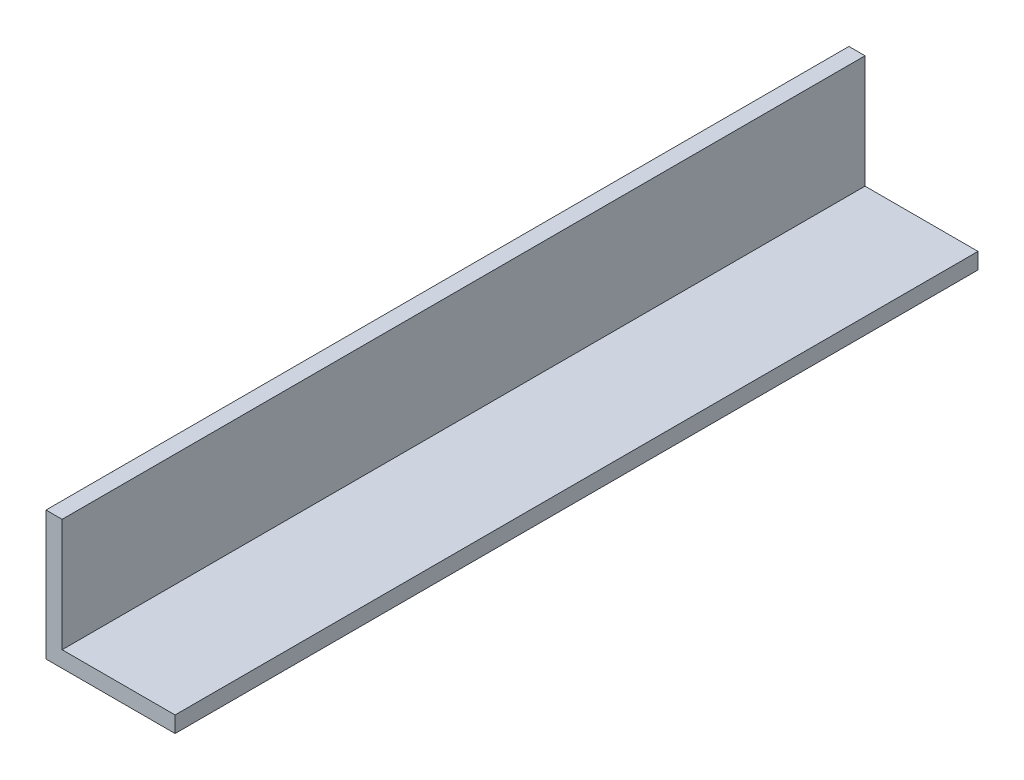
ISO-10303-21;
HEADER;
FILE_DESCRIPTION(('STEP AP214'),'2;1');
FILE_NAME('part.step','',(''),(''),'','','');
FILE_SCHEMA(('AUTOMOTIVE_DESIGN { 1 0 10303 214 1 1 1 1 }'));
ENDSEC;
DATA;
#1=APPLICATION_CONTEXT('core data for automotive mechanical design processes');
#2=APPLICATION_PROTOCOL_DEFINITION('international standard','automotive_design',2000,#1);
#3=PRODUCT_CONTEXT('',#1,'mechanical');
#4=PRODUCT('Part','Part','',(#3));
#5=PRODUCT_RELATED_PRODUCT_CATEGORY('part','',(#4));
#6=PRODUCT_DEFINITION_FORMATION('','',#4);
#7=PRODUCT_DEFINITION_CONTEXT('part definition',#1,'design');
#8=PRODUCT_DEFINITION('design','',#6,#7);
#9=PRODUCT_DEFINITION_SHAPE('','',#8);
#10=(LENGTH_UNIT() NAMED_UNIT(*) SI_UNIT(.MILLI.,.METRE.));
#11=(NAMED_UNIT(*) PLANE_ANGLE_UNIT() SI_UNIT($,.RADIAN.));
#12=(NAMED_UNIT(*) SI_UNIT($,.STERADIAN.) SOLID_ANGLE_UNIT());
#13=UNCERTAINTY_MEASURE_WITH_UNIT(LENGTH_MEASURE(1.E-05),#10,'distance_accuracy_value','');
#14=(GEOMETRIC_REPRESENTATION_CONTEXT(3) GLOBAL_UNCERTAINTY_ASSIGNED_CONTEXT((#13)) GLOBAL_UNIT_ASSIGNED_CONTEXT((#10,
#11,#12)) REPRESENTATION_CONTEXT('',''));
#15=CARTESIAN_POINT('',(0.,0.,0.));
#16=DIRECTION('',(0.,0.,1.));
#17=DIRECTION('',(1.,0.,0.));
#18=AXIS2_PLACEMENT_3D('',#15,#16,#17);
#19=CARTESIAN_POINT('',(0.,0.,158.));
#20=DIRECTION('',(1.,0.,0.));
#21=DIRECTION('',(0.,0.,-1.));
#22=AXIS2_PLACEMENT_3D('',#19,#20,#21);
#23=PLANE('',#22);
#24=DIRECTION('',(0.,-1.,0.));
#25=VECTOR('',#24,1.);
#26=CARTESIAN_POINT('',(0.,0.,0.));
#27=LINE('',#26,#25);
#28=CARTESIAN_POINT('',(0.,25.4,0.));
#29=VERTEX_POINT('',#28);
#30=CARTESIAN_POINT('',(0.,0.,0.));
#31=VERTEX_POINT('',#30);
#32=EDGE_CURVE('E117',#29,#31,#27,.T.);
#33=ORIENTED_EDGE('',*,*,#32,.T.);
#34=DIRECTION('',(0.,0.,-1.));
#35=VECTOR('',#34,1.);
#36=CARTESIAN_POINT('',(0.,0.,158.));
#37=LINE('',#36,#35);
#38=CARTESIAN_POINT('',(0.,0.,158.));
#39=VERTEX_POINT('',#38);
#40=EDGE_CURVE('E11',#39,#31,#37,.T.);
#41=ORIENTED_EDGE('',*,*,#40,.F.);
#42=DIRECTION('',(0.,-1.,0.));
#43=VECTOR('',#42,1.);
#44=CARTESIAN_POINT('',(0.,0.,158.));
#45=LINE('',#44,#43);
#46=CARTESIAN_POINT('',(0.,25.4,158.));
#47=VERTEX_POINT('',#46);
#48=EDGE_CURVE('E127',#47,#39,#45,.T.);
#49=ORIENTED_EDGE('',*,*,#48,.F.);
#50=DIRECTION('',(0.,0.,-1.));
#51=VECTOR('',#50,1.);
#52=CARTESIAN_POINT('',(0.,25.4,158.));
#53=LINE('',#52,#51);
#54=EDGE_CURVE('E113',#47,#29,#53,.T.);
#55=ORIENTED_EDGE('',*,*,#54,.T.);
#56=EDGE_LOOP('',(#33,#41,#49,#55));
#57=FACE_BOUND('',#56,.T.);
#58=ADVANCED_FACE('F33',(#57),#23,.F.);
#59=CARTESIAN_POINT('',(0.,0.,158.));
#60=DIRECTION('',(0.,1.,0.));
#61=DIRECTION('',(0.,0.,1.));
#62=AXIS2_PLACEMENT_3D('',#59,#60,#61);
#63=PLANE('',#62);
#64=DIRECTION('',(1.,0.,0.));
#65=VECTOR('',#64,1.);
#66=CARTESIAN_POINT('',(0.,0.,0.));
#67=LINE('',#66,#65);
#68=CARTESIAN_POINT('',(25.4,0.,0.));
#69=VERTEX_POINT('',#68);
#70=EDGE_CURVE('E120',#31,#69,#67,.T.);
#71=ORIENTED_EDGE('',*,*,#70,.T.);
#72=DIRECTION('',(0.,0.,-1.));
#73=VECTOR('',#72,1.);
#74=CARTESIAN_POINT('',(25.4,0.,158.));
#75=LINE('',#74,#73);
#76=CARTESIAN_POINT('',(25.4,0.,158.));
#77=VERTEX_POINT('',#76);
#78=EDGE_CURVE('E41',#77,#69,#75,.T.);
#79=ORIENTED_EDGE('',*,*,#78,.F.);
#80=DIRECTION('',(1.,0.,0.));
#81=VECTOR('',#80,1.);
#82=CARTESIAN_POINT('',(0.,0.,158.));
#83=LINE('',#82,#81);
#84=EDGE_CURVE('E86',#39,#77,#83,.T.);
#85=ORIENTED_EDGE('',*,*,#84,.F.);
#86=ORIENTED_EDGE('',*,*,#40,.T.);
#87=EDGE_LOOP('',(#71,#79,#85,#86));
#88=FACE_BOUND('',#87,.T.);
#89=ADVANCED_FACE('F151',(#88),#63,.F.);
#90=CARTESIAN_POINT('',(25.4,0.,158.));
#91=DIRECTION('',(-1.,0.,0.));
#92=DIRECTION('',(0.,0.,1.));
#93=AXIS2_PLACEMENT_3D('',#90,#91,#92);
#94=PLANE('',#93);
#95=DIRECTION('',(0.,1.,0.));
#96=VECTOR('',#95,1.);
#97=CARTESIAN_POINT('',(25.4,0.,0.));
#98=LINE('',#97,#96);
#99=CARTESIAN_POINT('',(25.4,3.175,0.));
#100=VERTEX_POINT('',#99);
#101=EDGE_CURVE('E122',#69,#100,#98,.T.);
#102=ORIENTED_EDGE('',*,*,#101,.T.);
#103=DIRECTION('',(0.,0.,-1.));
#104=VECTOR('',#103,1.);
#105=CARTESIAN_POINT('',(25.4,3.175,158.));
#106=LINE('',#105,#104);
#107=CARTESIAN_POINT('',(25.4,3.175,158.));
#108=VERTEX_POINT('',#107);
#109=EDGE_CURVE('E108',#108,#100,#106,.T.);
#110=ORIENTED_EDGE('',*,*,#109,.F.);
#111=DIRECTION('',(0.,1.,0.));
#112=VECTOR('',#111,1.);
#113=CARTESIAN_POINT('',(25.4,0.,158.));
#114=LINE('',#113,#112);
#115=EDGE_CURVE('E99',#77,#108,#114,.T.);
#116=ORIENTED_EDGE('',*,*,#115,.F.);
#117=ORIENTED_EDGE('',*,*,#78,.T.);
#118=EDGE_LOOP('',(#102,#110,#116,#117));
#119=FACE_BOUND('',#118,.T.);
#120=ADVANCED_FACE('F133',(#119),#94,.F.);
#121=CARTESIAN_POINT('',(25.4,3.175,158.));
#122=DIRECTION('',(0.,-1.,0.));
#123=DIRECTION('',(1.,0.,0.));
#124=AXIS2_PLACEMENT_3D('',#121,#122,#123);
#125=PLANE('',#124);
#126=DIRECTION('',(-1.,0.,0.));
#127=VECTOR('',#126,1.);
#128=CARTESIAN_POINT('',(25.4,3.175,0.));
#129=LINE('',#128,#127);
#130=CARTESIAN_POINT('',(3.175,3.175,0.));
#131=VERTEX_POINT('',#130);
#132=EDGE_CURVE('E107',#100,#131,#129,.T.);
#133=ORIENTED_EDGE('',*,*,#132,.T.);
#134=DIRECTION('',(0.,0.,-1.));
#135=VECTOR('',#134,1.);
#136=CARTESIAN_POINT('',(3.175,3.175,158.));
#137=LINE('',#136,#135);
#138=CARTESIAN_POINT('',(3.175,3.175,158.));
#139=VERTEX_POINT('',#138);
#140=EDGE_CURVE('E104',#139,#131,#137,.T.);
#141=ORIENTED_EDGE('',*,*,#140,.F.);
#142=DIRECTION('',(-1.,0.,0.));
#143=VECTOR('',#142,1.);
#144=CARTESIAN_POINT('',(25.4,3.175,158.));
#145=LINE('',#144,#143);
#146=EDGE_CURVE('E93',#108,#139,#145,.T.);
#147=ORIENTED_EDGE('',*,*,#146,.F.);
#148=ORIENTED_EDGE('',*,*,#109,.T.);
#149=EDGE_LOOP('',(#133,#141,#147,#148));
#150=FACE_BOUND('',#149,.T.);
#151=ADVANCED_FACE('F105',(#150),#125,.F.);
#152=CARTESIAN_POINT('',(3.175,25.4,158.));
#153=DIRECTION('',(-1.,0.,0.));
#154=DIRECTION('',(0.,-1.,0.));
#155=AXIS2_PLACEMENT_3D('',#152,#153,#154);
#156=PLANE('',#155);
#157=DIRECTION('',(0.,1.,0.));
#158=VECTOR('',#157,1.);
#159=CARTESIAN_POINT('',(3.175,25.4,0.));
#160=LINE('',#159,#158);
#161=CARTESIAN_POINT('',(3.175,25.4,0.));
#162=VERTEX_POINT('',#161);
#163=EDGE_CURVE('E72',#131,#162,#160,.T.);
#164=ORIENTED_EDGE('',*,*,#163,.T.);
#165=DIRECTION('',(0.,0.,-1.));
#166=VECTOR('',#165,1.);
#167=CARTESIAN_POINT('',(3.175,25.4,158.));
#168=LINE('',#167,#166);
#169=CARTESIAN_POINT('',(3.175,25.4,158.));
#170=VERTEX_POINT('',#169);
#171=EDGE_CURVE('E109',#170,#162,#168,.T.);
#172=ORIENTED_EDGE('',*,*,#171,.F.);
#173=DIRECTION('',(0.,1.,0.));
#174=VECTOR('',#173,1.);
#175=CARTESIAN_POINT('',(3.175,25.4,158.));
#176=LINE('',#175,#174);
#177=EDGE_CURVE('E97',#139,#170,#176,.T.);
#178=ORIENTED_EDGE('',*,*,#177,.F.);
#179=ORIENTED_EDGE('',*,*,#140,.T.);
#180=EDGE_LOOP('',(#164,#172,#178,#179));
#181=FACE_BOUND('',#180,.T.);
#182=ADVANCED_FACE('F111',(#181),#156,.F.);
#183=CARTESIAN_POINT('',(0.,25.4,158.));
#184=DIRECTION('',(0.,-1.,0.));
#185=DIRECTION('',(0.,0.,-1.));
#186=AXIS2_PLACEMENT_3D('',#183,#184,#185);
#187=PLANE('',#186);
#188=DIRECTION('',(-1.,0.,0.));
#189=VECTOR('',#188,1.);
#190=CARTESIAN_POINT('',(0.,25.4,0.));
#191=LINE('',#190,#189);
#192=EDGE_CURVE('E78',#162,#29,#191,.T.);
#193=ORIENTED_EDGE('',*,*,#192,.T.);
#194=ORIENTED_EDGE('',*,*,#54,.F.);
#195=DIRECTION('',(-1.,0.,0.));
#196=VECTOR('',#195,1.);
#197=CARTESIAN_POINT('',(0.,25.4,158.));
#198=LINE('',#197,#196);
#199=EDGE_CURVE('E49',#170,#47,#198,.T.);
#200=ORIENTED_EDGE('',*,*,#199,.F.);
#201=ORIENTED_EDGE('',*,*,#171,.T.);
#202=EDGE_LOOP('',(#193,#194,#200,#201));
#203=FACE_BOUND('',#202,.T.);
#204=ADVANCED_FACE('F140',(#203),#187,.F.);
#205=CARTESIAN_POINT('',(0.,0.,158.));
#206=DIRECTION('',(0.,0.,-1.));
#207=DIRECTION('',(-1.,0.,0.));
#208=AXIS2_PLACEMENT_3D('',#205,#206,#207);
#209=PLANE('',#208);
#210=ORIENTED_EDGE('',*,*,#48,.T.);
#211=ORIENTED_EDGE('',*,*,#84,.T.);
#212=ORIENTED_EDGE('',*,*,#115,.T.);
#213=ORIENTED_EDGE('',*,*,#146,.T.);
#214=ORIENTED_EDGE('',*,*,#177,.T.);
#215=ORIENTED_EDGE('',*,*,#199,.T.);
#216=EDGE_LOOP('',(#210,#211,#212,#213,#214,#215));
#217=FACE_BOUND('',#216,.T.);
#218=ADVANCED_FACE('F95',(#217),#209,.F.);
#219=CARTESIAN_POINT('',(0.,0.,0.));
#220=DIRECTION('',(0.,0.,-1.));
#221=DIRECTION('',(-1.,0.,0.));
#222=AXIS2_PLACEMENT_3D('',#219,#220,#221);
#223=PLANE('',#222);
#224=ORIENTED_EDGE('',*,*,#32,.F.);
#225=ORIENTED_EDGE('',*,*,#192,.F.);
#226=ORIENTED_EDGE('',*,*,#163,.F.);
#227=ORIENTED_EDGE('',*,*,#132,.F.);
#228=ORIENTED_EDGE('',*,*,#101,.F.);
#229=ORIENTED_EDGE('',*,*,#70,.F.);
#230=EDGE_LOOP('',(#224,#225,#226,#227,#228,#229));
#231=FACE_BOUND('',#230,.T.);
#232=ADVANCED_FACE('F136',(#231),#223,.T.);
#233=CLOSED_SHELL('',(#58,#89,#120,#151,#182,#204,#218,#232));
#234=MANIFOLD_SOLID_BREP('B2',#233);
#235=ADVANCED_BREP_SHAPE_REPRESENTATION('',(#18,#234),#14);
#236=SHAPE_DEFINITION_REPRESENTATION(#9,#235);
ENDSEC;
END-ISO-10303-21;
